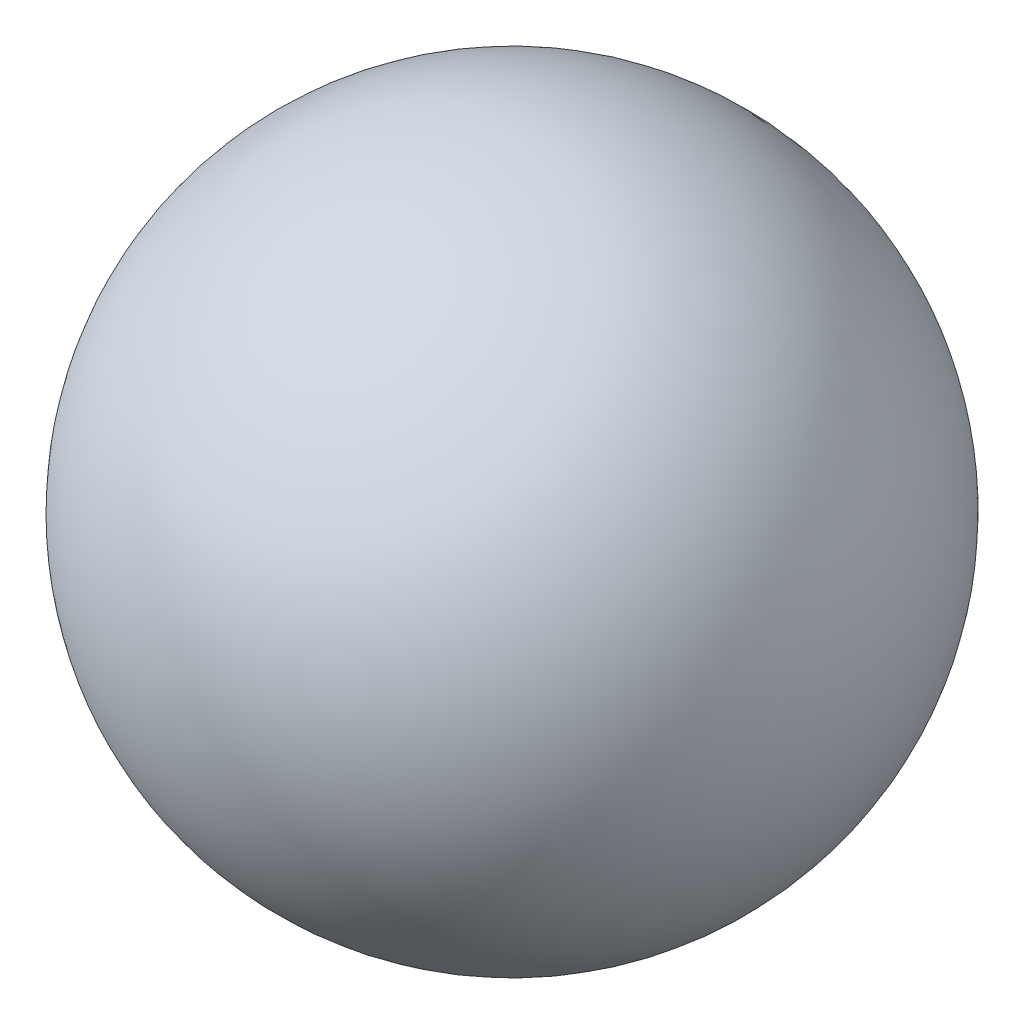
ISO-10303-21;
HEADER;
FILE_DESCRIPTION(('STEP AP214'),'2;1');
FILE_NAME('part.step','',(''),(''),'','','');
FILE_SCHEMA(('AUTOMOTIVE_DESIGN { 1 0 10303 214 1 1 1 1 }'));
ENDSEC;
DATA;
#1=APPLICATION_CONTEXT('core data for automotive mechanical design processes');
#2=APPLICATION_PROTOCOL_DEFINITION('international standard','automotive_design',2000,#1);
#3=PRODUCT_CONTEXT('',#1,'mechanical');
#4=PRODUCT('Part','Part','',(#3));
#5=PRODUCT_RELATED_PRODUCT_CATEGORY('part','',(#4));
#6=PRODUCT_DEFINITION_FORMATION('','',#4);
#7=PRODUCT_DEFINITION_CONTEXT('part definition',#1,'design');
#8=PRODUCT_DEFINITION('design','',#6,#7);
#9=PRODUCT_DEFINITION_SHAPE('','',#8);
#10=(LENGTH_UNIT() NAMED_UNIT(*) SI_UNIT(.MILLI.,.METRE.));
#11=(NAMED_UNIT(*) PLANE_ANGLE_UNIT() SI_UNIT($,.RADIAN.));
#12=(NAMED_UNIT(*) SI_UNIT($,.STERADIAN.) SOLID_ANGLE_UNIT());
#13=UNCERTAINTY_MEASURE_WITH_UNIT(LENGTH_MEASURE(1.E-05),#10,'distance_accuracy_value','');
#14=(GEOMETRIC_REPRESENTATION_CONTEXT(3) GLOBAL_UNCERTAINTY_ASSIGNED_CONTEXT((#13)) GLOBAL_UNIT_ASSIGNED_CONTEXT((#10,
#11,#12)) REPRESENTATION_CONTEXT('',''));
#15=CARTESIAN_POINT('',(0.,0.,0.));
#16=DIRECTION('',(0.,0.,1.));
#17=DIRECTION('',(1.,0.,0.));
#18=AXIS2_PLACEMENT_3D('',#15,#16,#17);
#19=CARTESIAN_POINT('',(64.16,-18.1355759759196,-66.9709009422872));
#20=DIRECTION('',(0.,-0.261383566232645,-0.965235013508889));
#21=DIRECTION('',(0.173648177666933,0.950570924782397,-0.257412562535889));
#22=AXIS2_PLACEMENT_3D('',#19,#20,#21);
#23=SPHERICAL_SURFACE('',#22,7.15);
#24=CARTESIAN_POINT('',(64.16,-16.2666834773562,-60.0694705956986));
#25=VERTEX_POINT('',#24);
#26=VERTEX_LOOP('',#25);
#27=FACE_BOUND('',#26,.T.);
#28=CARTESIAN_POINT('',(64.16,-20.004468474483,-73.8723312888757));
#29=VERTEX_POINT('',#28);
#30=VERTEX_LOOP('',#29);
#31=FACE_BOUND('',#30,.T.);
#32=ADVANCED_FACE('F15',(#27,#31),#23,.T.);
#33=CLOSED_SHELL('',(#32));
#34=MANIFOLD_SOLID_BREP('B1',#33);
#35=ADVANCED_BREP_SHAPE_REPRESENTATION('',(#18,#34),#14);
#36=SHAPE_DEFINITION_REPRESENTATION(#9,#35);
ENDSEC;
END-ISO-10303-21;
